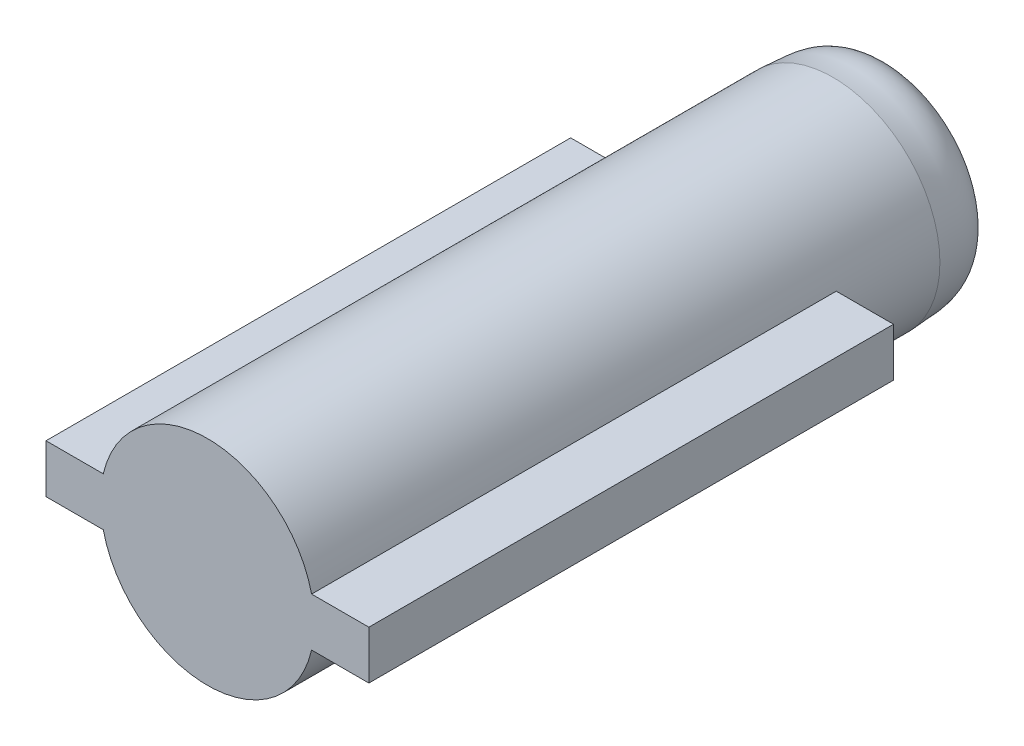
ISO-10303-21;
HEADER;
FILE_DESCRIPTION(('STEP AP214'),'2;1');
FILE_NAME('part.step','',(''),(''),'','','');
FILE_SCHEMA(('AUTOMOTIVE_DESIGN { 1 0 10303 214 1 1 1 1 }'));
ENDSEC;
DATA;
#1=APPLICATION_CONTEXT('core data for automotive mechanical design processes');
#2=APPLICATION_PROTOCOL_DEFINITION('international standard','automotive_design',2000,#1);
#3=PRODUCT_CONTEXT('',#1,'mechanical');
#4=PRODUCT('Part','Part','',(#3));
#5=PRODUCT_RELATED_PRODUCT_CATEGORY('part','',(#4));
#6=PRODUCT_DEFINITION_FORMATION('','',#4);
#7=PRODUCT_DEFINITION_CONTEXT('part definition',#1,'design');
#8=PRODUCT_DEFINITION('design','',#6,#7);
#9=PRODUCT_DEFINITION_SHAPE('','',#8);
#10=(LENGTH_UNIT() NAMED_UNIT(*) SI_UNIT(.MILLI.,.METRE.));
#11=(NAMED_UNIT(*) PLANE_ANGLE_UNIT() SI_UNIT($,.RADIAN.));
#12=(NAMED_UNIT(*) SI_UNIT($,.STERADIAN.) SOLID_ANGLE_UNIT());
#13=UNCERTAINTY_MEASURE_WITH_UNIT(LENGTH_MEASURE(1.E-05),#10,'distance_accuracy_value','');
#14=(GEOMETRIC_REPRESENTATION_CONTEXT(3) GLOBAL_UNCERTAINTY_ASSIGNED_CONTEXT((#13)) GLOBAL_UNIT_ASSIGNED_CONTEXT((#10,
#11,#12)) REPRESENTATION_CONTEXT('',''));
#15=CARTESIAN_POINT('',(0.,0.,0.));
#16=DIRECTION('',(0.,0.,1.));
#17=DIRECTION('',(1.,0.,0.));
#18=AXIS2_PLACEMENT_3D('',#15,#16,#17);
#19=CARTESIAN_POINT('',(0.,0.,17.));
#20=DIRECTION('',(0.,0.,-1.));
#21=DIRECTION('',(-1.,0.,0.));
#22=AXIS2_PLACEMENT_3D('',#19,#20,#21);
#23=CYLINDRICAL_SURFACE('',#22,2.65);
#24=CARTESIAN_POINT('',(0.,0.,1.50000000000001));
#25=DIRECTION('',(0.,0.,-1.));
#26=DIRECTION('',(-1.,0.,0.));
#27=AXIS2_PLACEMENT_3D('',#24,#25,#26);
#28=CIRCLE('',#27,2.65);
#29=CARTESIAN_POINT('',(-2.65,0.,1.50000000000001));
#30=VERTEX_POINT('',#29);
#31=EDGE_CURVE('E196',#30,#30,#28,.T.);
#32=ORIENTED_EDGE('',*,*,#31,.F.);
#33=EDGE_LOOP('',(#32));
#34=FACE_BOUND('',#33,.T.);
#35=CARTESIAN_POINT('',(0.,0.,4.));
#36=DIRECTION('',(0.,0.,1.));
#37=DIRECTION('',(1.,0.,0.));
#38=AXIS2_PLACEMENT_3D('',#35,#36,#37);
#39=CIRCLE('',#38,2.65);
#40=CARTESIAN_POINT('',(-2.58118189982806,0.6,4.));
#41=VERTEX_POINT('',#40);
#42=CARTESIAN_POINT('',(-2.58118189982806,-0.6,4.));
#43=VERTEX_POINT('',#42);
#44=EDGE_CURVE('E11',#41,#43,#39,.T.);
#45=ORIENTED_EDGE('',*,*,#44,.F.);
#46=DIRECTION('',(0.,0.,-1.));
#47=VECTOR('',#46,1.);
#48=CARTESIAN_POINT('',(-2.58118189982806,0.6,17.));
#49=LINE('',#48,#47);
#50=CARTESIAN_POINT('',(-2.58118189982806,0.6,17.));
#51=VERTEX_POINT('',#50);
#52=EDGE_CURVE('E151',#41,#51,#49,.F.);
#53=ORIENTED_EDGE('',*,*,#52,.T.);
#54=CARTESIAN_POINT('',(0.,0.,17.));
#55=DIRECTION('',(0.,0.,1.));
#56=DIRECTION('',(1.,0.,0.));
#57=AXIS2_PLACEMENT_3D('',#54,#55,#56);
#58=CIRCLE('',#57,2.65);
#59=CARTESIAN_POINT('',(2.58118189982806,0.6,17.));
#60=VERTEX_POINT('',#59);
#61=EDGE_CURVE('E157',#60,#51,#58,.T.);
#62=ORIENTED_EDGE('',*,*,#61,.F.);
#63=DIRECTION('',(0.,0.,-1.));
#64=VECTOR('',#63,1.);
#65=CARTESIAN_POINT('',(2.58118189982806,0.6,17.));
#66=LINE('',#65,#64);
#67=CARTESIAN_POINT('',(2.58118189982806,0.6,4.));
#68=VERTEX_POINT('',#67);
#69=EDGE_CURVE('E154',#60,#68,#66,.T.);
#70=ORIENTED_EDGE('',*,*,#69,.T.);
#71=CARTESIAN_POINT('',(2.58118189982806,-0.6,4.));
#72=VERTEX_POINT('',#71);
#73=EDGE_CURVE('E37',#72,#68,#39,.T.);
#74=ORIENTED_EDGE('',*,*,#73,.F.);
#75=DIRECTION('',(0.,0.,-1.));
#76=VECTOR('',#75,1.);
#77=CARTESIAN_POINT('',(2.58118189982806,-0.599999999999999,17.));
#78=LINE('',#77,#76);
#79=CARTESIAN_POINT('',(2.58118189982806,-0.6,17.));
#80=VERTEX_POINT('',#79);
#81=EDGE_CURVE('E142',#72,#80,#78,.F.);
#82=ORIENTED_EDGE('',*,*,#81,.T.);
#83=CARTESIAN_POINT('',(-2.58118189982806,-0.6,17.));
#84=VERTEX_POINT('',#83);
#85=EDGE_CURVE('E156',#84,#80,#58,.T.);
#86=ORIENTED_EDGE('',*,*,#85,.F.);
#87=DIRECTION('',(0.,0.,-1.));
#88=VECTOR('',#87,1.);
#89=CARTESIAN_POINT('',(-2.58118189982806,-0.6,17.));
#90=LINE('',#89,#88);
#91=EDGE_CURVE('E149',#84,#43,#90,.T.);
#92=ORIENTED_EDGE('',*,*,#91,.T.);
#93=EDGE_LOOP('',(#45,#53,#62,#70,#74,#82,#86,#92));
#94=FACE_BOUND('',#93,.T.);
#95=ADVANCED_FACE('F34',(#34,#94),#23,.T.);
#96=CARTESIAN_POINT('',(0.,0.,17.));
#97=DIRECTION('',(0.,0.,1.));
#98=DIRECTION('',(1.,0.,0.));
#99=AXIS2_PLACEMENT_3D('',#96,#97,#98);
#100=PLANE('',#99);
#101=ORIENTED_EDGE('',*,*,#85,.T.);
#102=DIRECTION('',(1.,0.,0.));
#103=VECTOR('',#102,1.);
#104=CARTESIAN_POINT('',(4.,-0.599999999999999,17.));
#105=LINE('',#104,#103);
#106=CARTESIAN_POINT('',(4.,-0.599999999999999,17.));
#107=VERTEX_POINT('',#106);
#108=EDGE_CURVE('E137',#80,#107,#105,.T.);
#109=ORIENTED_EDGE('',*,*,#108,.T.);
#110=DIRECTION('',(0.,1.,0.));
#111=VECTOR('',#110,1.);
#112=CARTESIAN_POINT('',(4.,-0.599999999999999,17.));
#113=LINE('',#112,#111);
#114=CARTESIAN_POINT('',(4.,0.600000000000001,17.));
#115=VERTEX_POINT('',#114);
#116=EDGE_CURVE('E139',#107,#115,#113,.T.);
#117=ORIENTED_EDGE('',*,*,#116,.T.);
#118=DIRECTION('',(-1.,0.,0.));
#119=VECTOR('',#118,1.);
#120=CARTESIAN_POINT('',(4.,0.600000000000001,17.));
#121=LINE('',#120,#119);
#122=EDGE_CURVE('E55',#115,#60,#121,.T.);
#123=ORIENTED_EDGE('',*,*,#122,.T.);
#124=ORIENTED_EDGE('',*,*,#61,.T.);
#125=CARTESIAN_POINT('',(-4.,0.6,17.));
#126=VERTEX_POINT('',#125);
#127=EDGE_CURVE('E124',#51,#126,#121,.T.);
#128=ORIENTED_EDGE('',*,*,#127,.T.);
#129=DIRECTION('',(0.,-1.,0.));
#130=VECTOR('',#129,1.);
#131=CARTESIAN_POINT('',(-4.,-0.6,17.));
#132=LINE('',#131,#130);
#133=CARTESIAN_POINT('',(-4.,-0.6,17.));
#134=VERTEX_POINT('',#133);
#135=EDGE_CURVE('E135',#126,#134,#132,.T.);
#136=ORIENTED_EDGE('',*,*,#135,.T.);
#137=EDGE_CURVE('E48',#134,#84,#105,.T.);
#138=ORIENTED_EDGE('',*,*,#137,.T.);
#139=EDGE_LOOP('',(#101,#109,#117,#123,#124,#128,#136,#138));
#140=FACE_BOUND('',#139,.T.);
#141=ADVANCED_FACE('F160',(#140),#100,.T.);
#142=CARTESIAN_POINT('',(4.,-0.599999999999999,4.));
#143=DIRECTION('',(1.,0.,0.));
#144=DIRECTION('',(0.,0.,-1.));
#145=AXIS2_PLACEMENT_3D('',#142,#143,#144);
#146=PLANE('',#145);
#147=ORIENTED_EDGE('',*,*,#116,.F.);
#148=DIRECTION('',(0.,0.,1.));
#149=VECTOR('',#148,1.);
#150=CARTESIAN_POINT('',(4.,-0.599999999999999,4.));
#151=LINE('',#150,#149);
#152=CARTESIAN_POINT('',(4.,-0.599999999999999,4.));
#153=VERTEX_POINT('',#152);
#154=EDGE_CURVE('E107',#153,#107,#151,.T.);
#155=ORIENTED_EDGE('',*,*,#154,.F.);
#156=DIRECTION('',(0.,1.,0.));
#157=VECTOR('',#156,1.);
#158=CARTESIAN_POINT('',(4.,-0.599999999999999,4.));
#159=LINE('',#158,#157);
#160=CARTESIAN_POINT('',(4.,0.600000000000001,4.));
#161=VERTEX_POINT('',#160);
#162=EDGE_CURVE('E116',#153,#161,#159,.T.);
#163=ORIENTED_EDGE('',*,*,#162,.T.);
#164=DIRECTION('',(0.,0.,1.));
#165=VECTOR('',#164,1.);
#166=CARTESIAN_POINT('',(4.,0.600000000000001,4.));
#167=LINE('',#166,#165);
#168=EDGE_CURVE('E143',#161,#115,#167,.T.);
#169=ORIENTED_EDGE('',*,*,#168,.T.);
#170=EDGE_LOOP('',(#147,#155,#163,#169));
#171=FACE_BOUND('',#170,.T.);
#172=ADVANCED_FACE('F173',(#171),#146,.T.);
#173=CARTESIAN_POINT('',(0.,0.,4.));
#174=DIRECTION('',(0.,0.,1.));
#175=DIRECTION('',(1.,0.,0.));
#176=AXIS2_PLACEMENT_3D('',#173,#174,#175);
#177=PLANE('',#176);
#178=DIRECTION('',(1.,0.,0.));
#179=VECTOR('',#178,1.);
#180=CARTESIAN_POINT('',(4.,-0.599999999999999,4.));
#181=LINE('',#180,#179);
#182=EDGE_CURVE('E117',#72,#153,#181,.T.);
#183=ORIENTED_EDGE('',*,*,#182,.F.);
#184=ORIENTED_EDGE('',*,*,#73,.T.);
#185=DIRECTION('',(-1.,0.,0.));
#186=VECTOR('',#185,1.);
#187=CARTESIAN_POINT('',(4.,0.600000000000001,4.));
#188=LINE('',#187,#186);
#189=EDGE_CURVE('E108',#161,#68,#188,.T.);
#190=ORIENTED_EDGE('',*,*,#189,.F.);
#191=ORIENTED_EDGE('',*,*,#162,.F.);
#192=EDGE_LOOP('',(#183,#184,#190,#191));
#193=FACE_BOUND('',#192,.T.);
#194=ADVANCED_FACE('F169',(#193),#177,.F.);
#195=CARTESIAN_POINT('',(4.,-0.599999999999999,4.));
#196=DIRECTION('',(0.,-1.,0.));
#197=DIRECTION('',(1.,0.,0.));
#198=AXIS2_PLACEMENT_3D('',#195,#196,#197);
#199=PLANE('',#198);
#200=ORIENTED_EDGE('',*,*,#81,.F.);
#201=ORIENTED_EDGE('',*,*,#182,.T.);
#202=ORIENTED_EDGE('',*,*,#154,.T.);
#203=ORIENTED_EDGE('',*,*,#108,.F.);
#204=EDGE_LOOP('',(#200,#201,#202,#203));
#205=FACE_BOUND('',#204,.T.);
#206=ADVANCED_FACE('F165',(#205),#199,.T.);
#207=CARTESIAN_POINT('',(4.,0.600000000000001,4.));
#208=DIRECTION('',(0.,1.,0.));
#209=DIRECTION('',(-1.,0.,0.));
#210=AXIS2_PLACEMENT_3D('',#207,#208,#209);
#211=PLANE('',#210);
#212=ORIENTED_EDGE('',*,*,#69,.F.);
#213=ORIENTED_EDGE('',*,*,#122,.F.);
#214=ORIENTED_EDGE('',*,*,#168,.F.);
#215=ORIENTED_EDGE('',*,*,#189,.T.);
#216=EDGE_LOOP('',(#212,#213,#214,#215));
#217=FACE_BOUND('',#216,.T.);
#218=ADVANCED_FACE('F175',(#217),#211,.T.);
#219=CARTESIAN_POINT('',(-4.,0.6,4.));
#220=VERTEX_POINT('',#219);
#221=EDGE_CURVE('E132',#41,#220,#188,.T.);
#222=ORIENTED_EDGE('',*,*,#221,.F.);
#223=ORIENTED_EDGE('',*,*,#44,.T.);
#224=CARTESIAN_POINT('',(-4.,-0.6,4.));
#225=VERTEX_POINT('',#224);
#226=EDGE_CURVE('E102',#225,#43,#181,.T.);
#227=ORIENTED_EDGE('',*,*,#226,.F.);
#228=DIRECTION('',(0.,-1.,0.));
#229=VECTOR('',#228,1.);
#230=CARTESIAN_POINT('',(-4.,-0.6,4.));
#231=LINE('',#230,#229);
#232=EDGE_CURVE('E114',#220,#225,#231,.T.);
#233=ORIENTED_EDGE('',*,*,#232,.F.);
#234=EDGE_LOOP('',(#222,#223,#227,#233));
#235=FACE_BOUND('',#234,.T.);
#236=ADVANCED_FACE('F113',(#235),#177,.F.);
#237=ORIENTED_EDGE('',*,*,#52,.F.);
#238=ORIENTED_EDGE('',*,*,#221,.T.);
#239=DIRECTION('',(0.,0.,1.));
#240=VECTOR('',#239,1.);
#241=CARTESIAN_POINT('',(-4.,0.6,4.));
#242=LINE('',#241,#240);
#243=EDGE_CURVE('E122',#220,#126,#242,.T.);
#244=ORIENTED_EDGE('',*,*,#243,.T.);
#245=ORIENTED_EDGE('',*,*,#127,.F.);
#246=EDGE_LOOP('',(#237,#238,#244,#245));
#247=FACE_BOUND('',#246,.T.);
#248=ADVANCED_FACE('F177',(#247),#211,.T.);
#249=ORIENTED_EDGE('',*,*,#91,.F.);
#250=ORIENTED_EDGE('',*,*,#137,.F.);
#251=DIRECTION('',(0.,0.,1.));
#252=VECTOR('',#251,1.);
#253=CARTESIAN_POINT('',(-4.,-0.6,4.));
#254=LINE('',#253,#252);
#255=EDGE_CURVE('E99',#225,#134,#254,.T.);
#256=ORIENTED_EDGE('',*,*,#255,.F.);
#257=ORIENTED_EDGE('',*,*,#226,.T.);
#258=EDGE_LOOP('',(#249,#250,#256,#257));
#259=FACE_BOUND('',#258,.T.);
#260=ADVANCED_FACE('F101',(#259),#199,.T.);
#261=CARTESIAN_POINT('',(-4.,-0.6,4.));
#262=DIRECTION('',(-1.,0.,0.));
#263=DIRECTION('',(0.,0.,1.));
#264=AXIS2_PLACEMENT_3D('',#261,#262,#263);
#265=PLANE('',#264);
#266=ORIENTED_EDGE('',*,*,#135,.F.);
#267=ORIENTED_EDGE('',*,*,#243,.F.);
#268=ORIENTED_EDGE('',*,*,#232,.T.);
#269=ORIENTED_EDGE('',*,*,#255,.T.);
#270=EDGE_LOOP('',(#266,#267,#268,#269));
#271=FACE_BOUND('',#270,.T.);
#272=ADVANCED_FACE('F120',(#271),#265,.T.);
#273=CARTESIAN_POINT('',(0.,2.65,1.50000000000001));
#274=CARTESIAN_POINT('',(0.,2.55537317860218,0.922815805737262));
#275=CARTESIAN_POINT('',(0.,2.84655662610956,-0.00317399949750963));
#276=CARTESIAN_POINT('',(0.,1.43187539710622,0.));
#277=B_SPLINE_CURVE_WITH_KNOTS('',3,(#273,#274,#275,#276),.UNSPECIFIED.,.F.,.F.,(4,4),(0.,
0.91074495904114),.UNSPECIFIED.);
#278=CARTESIAN_POINT('',(0.,0.,0.));
#279=DIRECTION('',(0.,0.,-1.));
#280=AXIS1_PLACEMENT('',#278,#279);
#281=SURFACE_OF_REVOLUTION('',#277,#280);
#282=CARTESIAN_POINT('',(0.,0.,0.));
#283=DIRECTION('',(0.,0.,-1.));
#284=DIRECTION('',(-1.,0.,0.));
#285=AXIS2_PLACEMENT_3D('',#282,#283,#284);
#286=CIRCLE('',#285,1.43187539710622);
#287=CARTESIAN_POINT('',(-1.43187539710622,0.,0.));
#288=VERTEX_POINT('',#287);
#289=EDGE_CURVE('E127',#288,#288,#286,.T.);
#290=ORIENTED_EDGE('',*,*,#289,.F.);
#291=EDGE_LOOP('',(#290));
#292=FACE_BOUND('',#291,.T.);
#293=ORIENTED_EDGE('',*,*,#31,.T.);
#294=EDGE_LOOP('',(#293));
#295=FACE_BOUND('',#294,.T.);
#296=ADVANCED_FACE('F207',(#292,#295),#281,.T.);
#297=CARTESIAN_POINT('',(0.,0.,0.));
#298=DIRECTION('',(0.,0.,1.));
#299=DIRECTION('',(1.,0.,0.));
#300=AXIS2_PLACEMENT_3D('',#297,#298,#299);
#301=PLANE('',#300);
#302=ORIENTED_EDGE('',*,*,#289,.T.);
#303=EDGE_LOOP('',(#302));
#304=FACE_BOUND('',#303,.T.);
#305=ADVANCED_FACE('F209',(#304),#301,.F.);
#306=CLOSED_SHELL('',(#95,#141,#172,#194,#206,#218,#236,#248,#260,#272,#296,#305));
#307=MANIFOLD_SOLID_BREP('B2',#306);
#308=ADVANCED_BREP_SHAPE_REPRESENTATION('',(#18,#307),#14);
#309=SHAPE_DEFINITION_REPRESENTATION(#9,#308);
ENDSEC;
END-ISO-10303-21;
